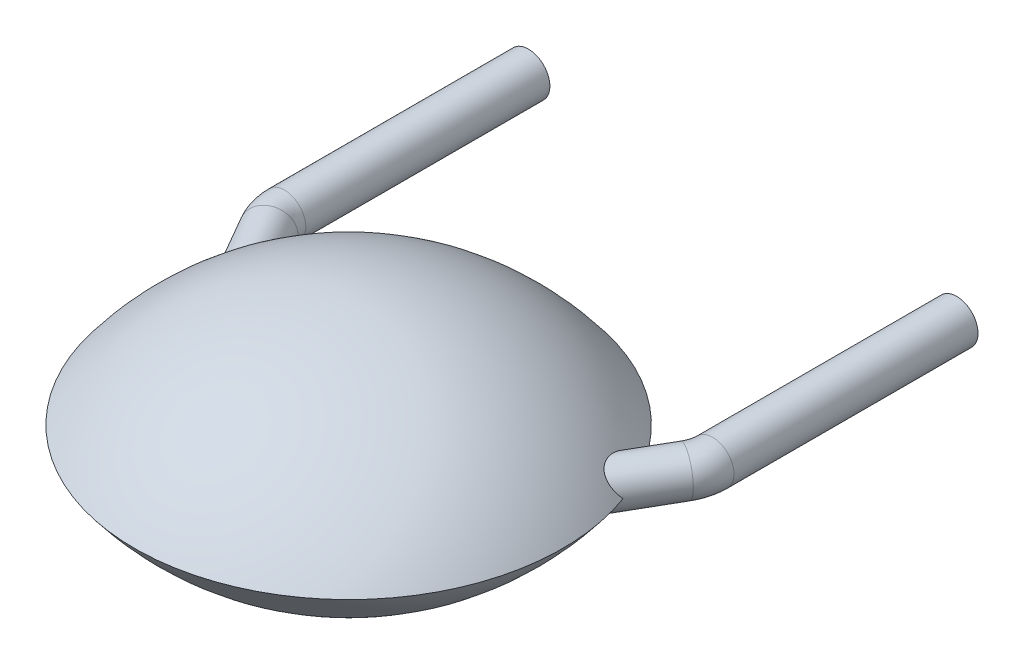
ISO-10303-21;
HEADER;
FILE_DESCRIPTION(('STEP AP214'),'2;1');
FILE_NAME('part.step','',(''),(''),'','','');
FILE_SCHEMA(('AUTOMOTIVE_DESIGN { 1 0 10303 214 1 1 1 1 }'));
ENDSEC;
DATA;
#1=APPLICATION_CONTEXT('core data for automotive mechanical design processes');
#2=APPLICATION_PROTOCOL_DEFINITION('international standard','automotive_design',2000,#1);
#3=PRODUCT_CONTEXT('',#1,'mechanical');
#4=PRODUCT('Part','Part','',(#3));
#5=PRODUCT_RELATED_PRODUCT_CATEGORY('part','',(#4));
#6=PRODUCT_DEFINITION_FORMATION('','',#4);
#7=PRODUCT_DEFINITION_CONTEXT('part definition',#1,'design');
#8=PRODUCT_DEFINITION('design','',#6,#7);
#9=PRODUCT_DEFINITION_SHAPE('','',#8);
#10=(LENGTH_UNIT() NAMED_UNIT(*) SI_UNIT(.MILLI.,.METRE.));
#11=(NAMED_UNIT(*) PLANE_ANGLE_UNIT() SI_UNIT($,.RADIAN.));
#12=(NAMED_UNIT(*) SI_UNIT($,.STERADIAN.) SOLID_ANGLE_UNIT());
#13=UNCERTAINTY_MEASURE_WITH_UNIT(LENGTH_MEASURE(1.E-05),#10,'distance_accuracy_value','');
#14=(GEOMETRIC_REPRESENTATION_CONTEXT(3) GLOBAL_UNCERTAINTY_ASSIGNED_CONTEXT((#13)) GLOBAL_UNIT_ASSIGNED_CONTEXT((#10,
#11,#12)) REPRESENTATION_CONTEXT('',''));
#15=CARTESIAN_POINT('',(0.,0.,0.));
#16=DIRECTION('',(0.,0.,1.));
#17=DIRECTION('',(1.,0.,0.));
#18=AXIS2_PLACEMENT_3D('',#15,#16,#17);
#19=CARTESIAN_POINT('',(-0.255,-0.25,-2.));
#20=DIRECTION('',(0.,0.,-1.));
#21=DIRECTION('',(0.,1.,0.));
#22=AXIS2_PLACEMENT_3D('',#19,#20,#21);
#23=PLANE('',#22);
#24=CARTESIAN_POINT('',(0.,1.26553498583371E-13,-2.));
#25=DIRECTION('',(0.,0.,-1.));
#26=DIRECTION('',(-1.,0.,0.));
#27=AXIS2_PLACEMENT_3D('',#24,#25,#26);
#28=CIRCLE('',#27,0.249999999999979);
#29=CARTESIAN_POINT('',(-0.249999999999979,1.26553498583371E-13,-2.));
#30=VERTEX_POINT('',#29);
#31=EDGE_CURVE('E22',#30,#30,#28,.F.);
#32=ORIENTED_EDGE('',*,*,#31,.F.);
#33=EDGE_LOOP('',(#32));
#34=FACE_BOUND('',#33,.T.);
#35=ADVANCED_FACE('F17',(#34),#23,.T.);
#36=CARTESIAN_POINT('',(5.255,0.25,-2.));
#37=DIRECTION('',(0.,0.,-1.));
#38=DIRECTION('',(0.,-1.,0.));
#39=AXIS2_PLACEMENT_3D('',#36,#37,#38);
#40=PLANE('',#39);
#41=CARTESIAN_POINT('',(5.,-1.2693296934374E-13,-2.));
#42=DIRECTION('',(0.,0.,-1.));
#43=DIRECTION('',(-1.,0.,0.));
#44=AXIS2_PLACEMENT_3D('',#41,#42,#43);
#45=CIRCLE('',#44,0.24999999999998);
#46=CARTESIAN_POINT('',(4.75000000000002,-1.2693296934374E-13,-2.));
#47=VERTEX_POINT('',#46);
#48=EDGE_CURVE('E87',#47,#47,#45,.F.);
#49=ORIENTED_EDGE('',*,*,#48,.F.);
#50=EDGE_LOOP('',(#49));
#51=FACE_BOUND('',#50,.T.);
#52=ADVANCED_FACE('F105',(#51),#40,.T.);
#53=CARTESIAN_POINT('',(0.,1.26553498583371E-13,0.85));
#54=DIRECTION('',(0.,0.,-1.));
#55=DIRECTION('',(-1.,0.,0.));
#56=AXIS2_PLACEMENT_3D('',#53,#54,#55);
#57=CYLINDRICAL_SURFACE('',#56,0.249999999999979);
#58=CARTESIAN_POINT('',(0.,1.26770339017868E-13,0.85));
#59=DIRECTION('',(0.,0.,-1.));
#60=DIRECTION('',(-1.,0.,0.));
#61=AXIS2_PLACEMENT_3D('',#58,#59,#60);
#62=CIRCLE('',#61,0.249999999999979);
#63=CARTESIAN_POINT('',(-0.249999999999979,1.26770339017868E-13,0.85));
#64=VERTEX_POINT('',#63);
#65=EDGE_CURVE('E65',#64,#64,#62,.T.);
#66=ORIENTED_EDGE('',*,*,#65,.T.);
#67=EDGE_LOOP('',(#66));
#68=FACE_BOUND('',#67,.T.);
#69=ORIENTED_EDGE('',*,*,#31,.T.);
#70=EDGE_LOOP('',(#69));
#71=FACE_BOUND('',#70,.T.);
#72=ADVANCED_FACE('F101',(#68,#71),#57,.T.);
#73=CARTESIAN_POINT('',(5.,-1.2693296934374E-13,0.85));
#74=DIRECTION('',(0.,0.,-1.));
#75=DIRECTION('',(-1.,0.,0.));
#76=AXIS2_PLACEMENT_3D('',#73,#74,#75);
#77=CYLINDRICAL_SURFACE('',#76,0.24999999999998);
#78=ORIENTED_EDGE('',*,*,#48,.T.);
#79=EDGE_LOOP('',(#78));
#80=FACE_BOUND('',#79,.T.);
#81=CARTESIAN_POINT('',(5.,-1.27082047142457E-13,0.85));
#82=DIRECTION('',(0.,0.,-1.));
#83=DIRECTION('',(-1.,0.,0.));
#84=AXIS2_PLACEMENT_3D('',#81,#82,#83);
#85=CIRCLE('',#84,0.249999999999979);
#86=CARTESIAN_POINT('',(5.24999999999998,-1.27082047142457E-13,0.85));
#87=VERTEX_POINT('',#86);
#88=EDGE_CURVE('E316',#87,#87,#85,.T.);
#89=ORIENTED_EDGE('',*,*,#88,.T.);
#90=EDGE_LOOP('',(#89));
#91=FACE_BOUND('',#90,.T.);
#92=ADVANCED_FACE('F97',(#80,#91),#77,.T.);
#93=CARTESIAN_POINT('',(0.499999999998368,1.26770339017868E-13,0.85));
#94=DIRECTION('',(0.,1.,0.));
#95=DIRECTION('',(0.,0.,1.));
#96=AXIS2_PLACEMENT_3D('',#93,#94,#95);
#97=TOROIDAL_SURFACE('',#96,0.499999999998368,0.249999999999979);
#98=CARTESIAN_POINT('',(0.0669872981077983,1.41637461308075E-13,1.10000000000003));
#99=DIRECTION('',(0.50000000000003,-1.46384386899602E-13,0.866025403784421));
#100=DIRECTION('',(0.866025403784421,0.,-0.50000000000003));
#101=AXIS2_PLACEMENT_3D('',#98,#99,#100);
#102=CIRCLE('',#101,0.24999999999994);
#103=CARTESIAN_POINT('',(-0.14951905283789,1.49071022453193E-13,1.22500000000028));
#104=VERTEX_POINT('',#103);
#105=EDGE_CURVE('E86',#104,#104,#102,.T.);
#106=CARTESIAN_POINT('',(0.499999999998368,1.26770339017868E-13,0.85));
#107=DIRECTION('',(0.,1.,0.));
#108=DIRECTION('',(0.,0.,1.));
#109=AXIS2_PLACEMENT_3D('',#106,#107,#108);
#110=CIRCLE('',#109,0.749999999998347);
#111=EDGE_CURVE('',#64,#104,#110,.T.);
#112=ORIENTED_EDGE('',*,*,#65,.F.);
#113=ORIENTED_EDGE('',*,*,#105,.F.);
#114=ORIENTED_EDGE('',*,*,#111,.T.);
#115=ORIENTED_EDGE('',*,*,#111,.F.);
#116=EDGE_LOOP('',(#112,#114,#113,#115));
#117=FACE_BOUND('',#116,.T.);
#118=ADVANCED_FACE('F93',(#117),#97,.T.);
#119=CARTESIAN_POINT('',(4.50000000000283,-1.27082047142457E-13,0.85));
#120=DIRECTION('',(0.,-1.,0.));
#121=DIRECTION('',(0.,0.,-1.));
#122=AXIS2_PLACEMENT_3D('',#119,#120,#121);
#123=TOROIDAL_SURFACE('',#122,0.499999999997168,0.249999999999979);
#124=CARTESIAN_POINT('',(4.933012701892,0.,1.1));
#125=DIRECTION('',(-0.499999999999811,0.,0.866025403784548));
#126=DIRECTION('',(0.866025403784548,0.,0.499999999999811));
#127=AXIS2_PLACEMENT_3D('',#124,#125,#126);
#128=CIRCLE('',#127,0.249999999999994);
#129=CARTESIAN_POINT('',(5.14951905283755,0.,1.22500000000056));
#130=VERTEX_POINT('',#129);
#131=EDGE_CURVE('E54',#130,#130,#128,.T.);
#132=CARTESIAN_POINT('',(4.50000000000283,-1.27082047142457E-13,0.85));
#133=DIRECTION('',(0.,-1.,0.));
#134=DIRECTION('',(0.,0.,-1.));
#135=AXIS2_PLACEMENT_3D('',#132,#133,#134);
#136=CIRCLE('',#135,0.749999999997148);
#137=EDGE_CURVE('',#87,#130,#136,.T.);
#138=ORIENTED_EDGE('',*,*,#88,.F.);
#139=ORIENTED_EDGE('',*,*,#131,.F.);
#140=ORIENTED_EDGE('',*,*,#137,.T.);
#141=ORIENTED_EDGE('',*,*,#137,.F.);
#142=EDGE_LOOP('',(#138,#140,#139,#141));
#143=FACE_BOUND('',#142,.T.);
#144=ADVANCED_FACE('F90',(#143),#123,.T.);
#145=CARTESIAN_POINT('',(0.432047896112033,-1.63335057284941E-13,1.73230350358406));
#146=DIRECTION('',(-0.49999999999942,2.59718178649785E-13,-0.866025403784774));
#147=DIRECTION('',(-0.866025403784774,0.,0.49999999999942));
#148=AXIS2_PLACEMENT_3D('',#145,#146,#147);
#149=CYLINDRICAL_SURFACE('',#148,0.249999999999962);
#150=CARTESIAN_POINT('',(0.420502910737567,2.39389986035229E-13,1.21230700234231));
#151=CARTESIAN_POINT('',(0.427297045209515,0.0162865407089759,1.22413023744057));
#152=CARTESIAN_POINT('',(0.433050977576928,0.0319920683808771,1.23721663849491));
#153=CARTESIAN_POINT('',(0.442659705904672,0.0620426895530233,1.26535228004791));
#154=CARTESIAN_POINT('',(0.446523503391992,0.076393963248698,1.28039177674211));
#155=CARTESIAN_POINT('',(0.45392733113162,0.10969010726406,1.31893045129104));
#156=CARTESIAN_POINT('',(0.456580477130958,0.127885525777837,1.34324485482007));
#157=CARTESIAN_POINT('',(0.45877685076235,0.161175058839322,1.39419877777848));
#158=CARTESIAN_POINT('',(0.458303644892437,0.176252355084398,1.42084985586591));
#159=CARTESIAN_POINT('',(0.454246934571025,0.202957953368596,1.47591772574734));
#160=CARTESIAN_POINT('',(0.450633941660921,0.214552149316315,1.50434887979139));
#161=CARTESIAN_POINT('',(0.439990762536356,0.233389052590254,1.56191626462155));
#162=CARTESIAN_POINT('',(0.432981670011264,0.240658011671839,1.59104710172731));
#163=CARTESIAN_POINT('',(0.420740846852407,0.2466815857034,1.6300060383598));
#164=CARTESIAN_POINT('',(0.417325503256664,0.247898059127778,1.64004696376177));
#165=CARTESIAN_POINT('',(0.40993164415724,0.249557409269351,1.65999537089405));
#166=CARTESIAN_POINT('',(0.405952879288816,0.249999942284038,1.66990279139855));
#167=CARTESIAN_POINT('',(0.396763605701014,0.250000065893,1.69085460050628));
#168=CARTESIAN_POINT('',(0.391458306012679,0.249421915418856,1.70185873540847));
#169=CARTESIAN_POINT('',(0.37995479011234,0.246902996902976,1.72323914433858));
#170=CARTESIAN_POINT('',(0.373757140969817,0.244963091216926,1.73361581120726));
#171=CARTESIAN_POINT('',(0.361649951424475,0.240003125401469,1.75150417677863));
#172=CARTESIAN_POINT('',(0.355896153185416,0.237246523618601,1.75919222876594));
#173=CARTESIAN_POINT('',(0.343800699800724,0.230588144916591,1.7735454784127));
#174=CARTESIAN_POINT('',(0.337459689341628,0.226687613926884,1.78021177696648));
#175=CARTESIAN_POINT('',(0.324251741098786,0.217691278489583,1.79223238657972));
#176=CARTESIAN_POINT('',(0.317380739512804,0.212585456621038,1.79757488792387));
#177=CARTESIAN_POINT('',(0.303396838953198,0.201328113425224,1.80657587835233));
#178=CARTESIAN_POINT('',(0.296284042692356,0.195177031784698,1.81023507312723));
#179=CARTESIAN_POINT('',(0.283045427623718,0.182962616763242,1.8153962090145));
#180=CARTESIAN_POINT('',(0.276914250807034,0.176996576244994,1.81712045724317));
#181=CARTESIAN_POINT('',(0.264836380457348,0.164664173727774,1.81928596597475));
#182=CARTESIAN_POINT('',(0.258889752272092,0.158297672289361,1.81972677703349));
#183=CARTESIAN_POINT('',(0.245009229256232,0.14278386371494,1.81939988632287));
#184=CARTESIAN_POINT('',(0.237212140194502,0.133526462590372,1.81808953209758));
#185=CARTESIAN_POINT('',(0.222320654489911,0.114877156640793,1.81365473015102));
#186=CARTESIAN_POINT('',(0.215228175495276,0.105484960304012,1.81052548244223));
#187=CARTESIAN_POINT('',(0.198436479373446,0.0820994414028457,1.80092379167508));
#188=CARTESIAN_POINT('',(0.189198153788796,0.0681441497888136,1.79356249901632));
#189=CARTESIAN_POINT('',(0.172324866275418,0.0406914782069809,1.77658508002494));
#190=CARTESIAN_POINT('',(0.164690448395588,0.0271942549143983,1.76696819092273));
#191=CARTESIAN_POINT('',(0.155352349120153,0.00928703044656987,1.75279466524938));
#192=CARTESIAN_POINT('',(0.152996105832129,0.00462384273548277,1.74896875579585));
#193=CARTESIAN_POINT('',(0.150731935252958,0.,1.74504996639581));
#194=B_SPLINE_CURVE_WITH_KNOTS('',3,(#150,#151,#152,#153,#154,#155,#156,#157,#158,#159,#160,
#161,#162,#163,#164,#165,#166,#167,#168,#169,#170,#171,#172,#173,#174,#175,#176,#177,#178,#179,
#180,#181,#182,#183,#184,#185,#186,#187,#188,#189,#190,#191,#192,#193),.UNSPECIFIED.,.F.,.F.,(4,
2,2,2,2,2,2,2,2,2,2,2,2,2,2,2,2,2,2,2,2,4),(0.,0.0635408324490006,0.126776040233785,
0.217773469902749,0.309249601881956,0.401594265385087,0.493372575202932,0.525365886287989,
0.557373401815039,0.593962578317446,0.630528604952221,0.660386214100727,0.690211423352895,
0.72029383141565,0.750363616547644,0.776431074614141,0.802507660092001,0.838826039319604,
0.875240699265292,0.929790545855562,0.984358866100693,1.00377729719556),.UNSPECIFIED.);
#195=CARTESIAN_POINT('',(0.42050291073755,4.10988589655373E-13,1.21230700234228));
#196=VERTEX_POINT('',#195);
#197=CARTESIAN_POINT('',(0.150731935253001,0.,1.74504996639589));
#198=VERTEX_POINT('',#197);
#199=EDGE_CURVE('E48',#196,#198,#194,.T.);
#200=ORIENTED_EDGE('',*,*,#199,.F.);
#201=CARTESIAN_POINT('',(0.150731935253043,-1.5147666491186E-13,1.74504996639596));
#202=CARTESIAN_POINT('',(0.158069546110411,-0.0149620895713352,1.7576803020235));
#203=CARTESIAN_POINT('',(0.166408260218829,-0.0304360475435922,1.76949406617795));
#204=CARTESIAN_POINT('',(0.185351820298398,-0.0622668893354946,1.79038408883657));
#205=CARTESIAN_POINT('',(0.195992273599596,-0.0786342187598399,1.79941119672931));
#206=CARTESIAN_POINT('',(0.213952224200793,-0.103737102356062,1.80985045374757));
#207=CARTESIAN_POINT('',(0.220440053552871,-0.112395102234936,1.81284177090283));
#208=CARTESIAN_POINT('',(0.23400497995342,-0.129596410206035,1.81730669948079));
#209=CARTESIAN_POINT('',(0.241079279843302,-0.138140059881649,1.81878711239551));
#210=CARTESIAN_POINT('',(0.254650670008347,-0.153661350784662,1.81983676220569));
#211=CARTESIAN_POINT('',(0.261076575072665,-0.160682564593136,1.81965802524135));
#212=CARTESIAN_POINT('',(0.274178822328835,-0.174289294516401,1.8177926009496));
#213=CARTESIAN_POINT('',(0.280855103200753,-0.180874916234801,1.81610628056584));
#214=CARTESIAN_POINT('',(0.294298915903356,-0.19339799565609,1.81112196349096));
#215=CARTESIAN_POINT('',(0.301066750337813,-0.199331573683687,1.80781489853012));
#216=CARTESIAN_POINT('',(0.314413111043318,-0.210277223890304,1.79965949351169));
#217=CARTESIAN_POINT('',(0.320991673498804,-0.215289473206863,1.79481145021763));
#218=CARTESIAN_POINT('',(0.333156360571336,-0.223846296378655,1.78432058478773));
#219=CARTESIAN_POINT('',(0.338777960506422,-0.227483833470902,1.77879304091473));
#220=CARTESIAN_POINT('',(0.3496002793179,-0.233886173997786,1.76688520756088));
#221=CARTESIAN_POINT('',(0.354800595967076,-0.236650150522158,1.7605041181977));
#222=CARTESIAN_POINT('',(0.367132935910447,-0.242479461710536,1.7438758251533));
#223=CARTESIAN_POINT('',(0.373986378414888,-0.24504675900636,1.73324875134983));
#224=CARTESIAN_POINT('',(0.386676583557055,-0.248594694405835,1.71118048875771));
#225=CARTESIAN_POINT('',(0.39251316766259,-0.249575054137185,1.69973915750366));
#226=CARTESIAN_POINT('',(0.399171405921399,-0.249963145158716,1.68529493164577));
#227=CARTESIAN_POINT('',(0.400430845280947,-0.249999868144702,1.68249279366295));
#228=CARTESIAN_POINT('',(0.410170171514729,-0.250000908576794,1.6602899628853));
#229=CARTESIAN_POINT('',(0.417480530078352,-0.24826440396279,1.64034740045281));
#230=CARTESIAN_POINT('',(0.4301127987804,-0.242091077068239,1.6002128133639));
#231=CARTESIAN_POINT('',(0.435423619948597,-0.237639544531413,1.58002002094819));
#232=CARTESIAN_POINT('',(0.446059898883694,-0.224332103335331,1.53199406797523));
#233=CARTESIAN_POINT('',(0.45057550494833,-0.214433828209814,1.50426781569258));
#234=CARTESIAN_POINT('',(0.456633031279002,-0.191086861637692,1.45002386973834));
#235=CARTESIAN_POINT('',(0.458172319458583,-0.17763503957204,1.42350726602326));
#236=CARTESIAN_POINT('',(0.458328544441139,-0.147304628145939,1.37183021729297));
#237=CARTESIAN_POINT('',(0.456890532089952,-0.130366894914194,1.34670421839335));
#238=CARTESIAN_POINT('',(0.450766785400385,-0.093549367623661,1.2992360799175));
#239=CARTESIAN_POINT('',(0.446094848658999,-0.0736823537313086,1.27688258737588));
#240=CARTESIAN_POINT('',(0.437006749266394,-0.0441553948540746,1.24845703285721));
#241=CARTESIAN_POINT('',(0.43414645606246,-0.0355934504470224,1.24071777392446));
#242=CARTESIAN_POINT('',(0.427803087889086,-0.0180804244863632,1.22595028774229));
#243=CARTESIAN_POINT('',(0.424319363396364,-0.0091289445269859,1.2189228141417));
#244=CARTESIAN_POINT('',(0.420502910737568,-2.40632941098382E-13,1.21230700234231));
#245=B_SPLINE_CURVE_WITH_KNOTS('',3,(#201,#202,#203,#204,#205,#206,#207,#208,#209,#210,#211,
#212,#213,#214,#215,#216,#217,#218,#219,#220,#221,#222,#223,#224,#225,#226,#227,#228,#229,#230,
#231,#232,#233,#234,#235,#236,#237,#238,#239,#240,#241,#242,#243,#244),.UNSPECIFIED.,.F.,.F.,(4,
2,2,2,2,2,2,2,2,2,2,2,2,2,2,2,2,2,2,2,2,4),(0.,0.0630548205121403,0.127165464985865,
0.160744649437198,0.194171997948385,0.222615770617751,0.25105262199751,0.279650429600491,
0.308242733135362,0.334185515792382,0.360152782777888,0.398648945036248,0.43715185935889,
0.446369113545147,0.509882490921038,0.573743084570674,0.662629445167236,0.751594375924578,
0.842215872314368,0.932453094536842,0.968087316367258,1.00375888225338),.UNSPECIFIED.);
#246=EDGE_CURVE('E45',#198,#196,#245,.T.);
#247=ORIENTED_EDGE('',*,*,#246,.F.);
#248=EDGE_LOOP('',(#200,#247));
#249=FACE_BOUND('',#248,.T.);
#250=ORIENTED_EDGE('',*,*,#105,.T.);
#251=EDGE_LOOP('',(#250));
#252=FACE_BOUND('',#251,.T.);
#253=ADVANCED_FACE('F73',(#249,#252),#149,.T.);
#254=CARTESIAN_POINT('',(4.56430149790796,0.,1.73862653861883));
#255=DIRECTION('',(0.499999999999809,0.,-0.866025403784549));
#256=DIRECTION('',(-0.866025403784549,0.,-0.499999999999809));
#257=AXIS2_PLACEMENT_3D('',#254,#255,#256);
#258=CYLINDRICAL_SURFACE('',#257,0.249999999999995);
#259=ORIENTED_EDGE('',*,*,#131,.T.);
#260=EDGE_LOOP('',(#259));
#261=FACE_BOUND('',#260,.T.);
#262=CARTESIAN_POINT('',(4.5794970892622,-3.19478933308572E-13,1.21230700234206));
#263=CARTESIAN_POINT('',(4.57270295479025,-0.0162865407090583,1.22413023744032));
#264=CARTESIAN_POINT('',(4.56694902242283,-0.0319920683809638,1.23721663849466));
#265=CARTESIAN_POINT('',(4.55734029409507,-0.0620426895531195,1.26535228004765));
#266=CARTESIAN_POINT('',(4.55347649660774,-0.0763939632487996,1.28039177674185));
#267=CARTESIAN_POINT('',(4.5460726688681,-0.109690107264174,1.31893045129077));
#268=CARTESIAN_POINT('',(4.54341952286876,-0.127885525777958,1.3432448548198));
#269=CARTESIAN_POINT('',(4.54122314923735,-0.16117505883946,1.3941987777782));
#270=CARTESIAN_POINT('',(4.54169635510725,-0.176252355084546,1.42084985586563));
#271=CARTESIAN_POINT('',(4.54575306542865,-0.202957953368766,1.47591772574706));
#272=CARTESIAN_POINT('',(4.54936605833875,-0.214552149316498,1.50434887979111));
#273=CARTESIAN_POINT('',(4.5600092374633,-0.233389052590444,1.56191626462127));
#274=CARTESIAN_POINT('',(4.56701832998839,-0.240658011672024,1.59104710172704));
#275=CARTESIAN_POINT('',(4.57925915314725,-0.24668158570361,1.63000603835951));
#276=CARTESIAN_POINT('',(4.58267449674299,-0.247898059127998,1.64004696376147));
#277=CARTESIAN_POINT('',(4.5900683558424,-0.249557409269547,1.65999537089373));
#278=CARTESIAN_POINT('',(4.59404712071081,-0.249999942284201,1.66990279139823));
#279=CARTESIAN_POINT('',(4.6032363942986,-0.250000065893162,1.69085460050595));
#280=CARTESIAN_POINT('',(4.60854169398695,-0.24942191541906,1.70185873540812));
#281=CARTESIAN_POINT('',(4.62004520988729,-0.246902996903214,1.72323914433821));
#282=CARTESIAN_POINT('',(4.6262428590298,-0.244963091217158,1.73361581120688));
#283=CARTESIAN_POINT('',(4.63835004857514,-0.240003125401703,1.75150417677824));
#284=CARTESIAN_POINT('',(4.6441038468142,-0.237246523618839,1.75919222876555));
#285=CARTESIAN_POINT('',(4.65619930019889,-0.230588144916836,1.77354547841231));
#286=CARTESIAN_POINT('',(4.66254031065798,-0.226687613927131,1.78021177696609));
#287=CARTESIAN_POINT('',(4.67574825890083,-0.217691278489834,1.79223238657933));
#288=CARTESIAN_POINT('',(4.68261926048681,-0.212585456621292,1.79757488792348));
#289=CARTESIAN_POINT('',(4.69660316104641,-0.201328113425484,1.80657587835193));
#290=CARTESIAN_POINT('',(4.70371595730726,-0.195177031784961,1.81023507312684));
#291=CARTESIAN_POINT('',(4.7169545723759,-0.182962616763509,1.81539620901412));
#292=CARTESIAN_POINT('',(4.72308574919258,-0.17699657624526,1.81712045724278));
#293=CARTESIAN_POINT('',(4.73516361954227,-0.164664173728041,1.81928596597437));
#294=CARTESIAN_POINT('',(4.74111024772753,-0.158297672289628,1.81972677703312));
#295=CARTESIAN_POINT('',(4.7549907707434,-0.142783863715204,1.8193998863225));
#296=CARTESIAN_POINT('',(4.76278785980514,-0.13352646259063,1.81808953209721));
#297=CARTESIAN_POINT('',(4.77767934550975,-0.114877156641041,1.81365473015066));
#298=CARTESIAN_POINT('',(4.78477182450439,-0.105484960304254,1.81052548244186));
#299=CARTESIAN_POINT('',(4.80156352062624,-0.0820994414030722,1.80092379167472));
#300=CARTESIAN_POINT('',(4.8108018462109,-0.0681441497890298,1.79356249901596));
#301=CARTESIAN_POINT('',(4.82767513372429,-0.0406914782071761,1.77658508002459));
#302=CARTESIAN_POINT('',(4.83530955160413,-0.0271942549145827,1.76696819092237));
#303=CARTESIAN_POINT('',(4.84464765087958,-0.00928703044674211,1.75279466524903));
#304=CARTESIAN_POINT('',(4.8470038941676,-0.00462384273565419,1.74896875579549));
#305=CARTESIAN_POINT('',(4.84926806474678,-1.48016485413765E-13,1.74504996639546));
#306=B_SPLINE_CURVE_WITH_KNOTS('',3,(#262,#263,#264,#265,#266,#267,#268,#269,#270,#271,#272,
#273,#274,#275,#276,#277,#278,#279,#280,#281,#282,#283,#284,#285,#286,#287,#288,#289,#290,#291,
#292,#293,#294,#295,#296,#297,#298,#299,#300,#301,#302,#303,#304,#305),.UNSPECIFIED.,.F.,.F.,(4,
2,2,2,2,2,2,2,2,2,2,2,2,2,2,2,2,2,2,2,2,4),(0.,0.0635408324490097,0.126776040233799,
0.217773469902769,0.309249601881987,0.401594265385129,0.493372575202974,0.525365886288001,
0.557373401815024,0.593962578317401,0.630528604952141,0.660386214100642,0.690211423352808,
0.720293831415559,0.75036361654755,0.776431074614052,0.802507660091917,0.838826039319544,
0.875240699265257,0.929790545855565,0.984358866100733,1.0037772971956),.UNSPECIFIED.);
#307=CARTESIAN_POINT('',(4.5794970892622,0.,1.21230700234206));
#308=VERTEX_POINT('',#307);
#309=CARTESIAN_POINT('',(4.8492680647468,1.6237201702297E-13,1.74504996639542));
#310=VERTEX_POINT('',#309);
#311=EDGE_CURVE('E28',#308,#310,#306,.T.);
#312=ORIENTED_EDGE('',*,*,#311,.F.);
#313=CARTESIAN_POINT('',(4.5794970892622,3.20395187520837E-13,1.21230700234206));
#314=CARTESIAN_POINT('',(4.57270295479044,0.0162865407085237,1.22413023743997));
#315=CARTESIAN_POINT('',(4.56694902242318,0.031992068379985,1.23721663849387));
#316=CARTESIAN_POINT('',(4.55734029409533,0.0620426895522529,1.26535228004674));
#317=CARTESIAN_POINT('',(4.55347649660786,0.0763939632484109,1.28039177674137));
#318=CARTESIAN_POINT('',(4.54607266886796,0.109690107264747,1.31893045129153));
#319=CARTESIAN_POINT('',(4.54341952286853,0.127885525778906,1.34324485482143));
#320=CARTESIAN_POINT('',(4.54122314923749,0.161175058840627,1.39419877777989));
#321=CARTESIAN_POINT('',(4.54169635510766,0.176252355085766,1.42084985586636));
#322=CARTESIAN_POINT('',(4.54575306542824,0.202957953367003,1.47591772574537));
#323=CARTESIAN_POINT('',(4.54936605833713,0.214552149311809,1.50434887978792));
#324=CARTESIAN_POINT('',(4.56000923746356,0.233389052592458,1.56191626461663));
#325=CARTESIAN_POINT('',(4.56701832999217,0.240658011683019,1.59104710172258));
#326=CARTESIAN_POINT('',(4.57925915320836,0.24668158573039,1.63000603855952));
#327=CARTESIAN_POINT('',(4.58267449687416,0.247898059165752,1.64004696416082));
#328=CARTESIAN_POINT('',(4.59006835614976,0.249557409330021,1.65999537167709));
#329=CARTESIAN_POINT('',(4.59404712112424,0.249999942356513,1.66990279236627));
#330=CARTESIAN_POINT('',(4.60323639482002,0.250000065894686,1.69085460157381));
#331=CARTESIAN_POINT('',(4.60854169449048,0.249421915353955,1.70185873639877));
#332=CARTESIAN_POINT('',(4.6200452103625,0.246902996753977,1.72323914516653));
#333=CARTESIAN_POINT('',(4.62624285949462,0.244963091050312,1.73361581195007));
#334=CARTESIAN_POINT('',(4.63835004902656,0.240003125197447,1.75150417739899));
#335=CARTESIAN_POINT('',(4.64410384726754,0.237246523390431,1.7591922293459));
#336=CARTESIAN_POINT('',(4.65619930065198,0.230588144646245,1.77354547890753));
#337=CARTESIAN_POINT('',(4.6625403111089,0.22668761363855,1.78021177741662));
#338=CARTESIAN_POINT('',(4.67574825933995,0.217691278171988,1.79223238693837));
#339=CARTESIAN_POINT('',(4.6826192609162,0.212585456292371,1.79757488823588));
#340=CARTESIAN_POINT('',(4.69660316145004,0.201328113083766,1.80657587857561));
#341=CARTESIAN_POINT('',(4.70371595769485,0.195177031441466,1.81023507330833));
#342=CARTESIAN_POINT('',(4.71695457274155,0.182962616413807,1.81539620913008));
#343=CARTESIAN_POINT('',(4.72308574955282,0.176996575888859,1.8171204573316));
#344=CARTESIAN_POINT('',(4.73516361988915,0.164664173362365,1.81928596601217));
#345=CARTESIAN_POINT('',(4.74111024806647,0.158297671921381,1.81972677704706));
#346=CARTESIAN_POINT('',(4.75499077108864,0.142783863314566,1.81939988628368));
#347=CARTESIAN_POINT('',(4.76278786016217,0.133526462160104,1.818089532024));
#348=CARTESIAN_POINT('',(4.77767934588536,0.114877156153896,1.81365473000538));
#349=CARTESIAN_POINT('',(4.78477182488677,0.105484959790386,1.81052548225887));
#350=CARTESIAN_POINT('',(4.80156352102834,0.0820994408150475,1.80092379139121));
#351=CARTESIAN_POINT('',(4.81080184662208,0.0681441491555374,1.79356249866626));
#352=CARTESIAN_POINT('',(4.82767513414342,0.0406914774896854,1.7765850795387));
#353=CARTESIAN_POINT('',(4.83530955202224,0.0271942541585315,1.76696819036664));
#354=CARTESIAN_POINT('',(4.8446476511441,0.00928702992336227,1.75279466481982));
#355=CARTESIAN_POINT('',(4.84700389429467,0.00462384247626404,1.74896875557582));
#356=CARTESIAN_POINT('',(4.84926806474669,3.22022890493245E-13,1.74504996639561));
#357=B_SPLINE_CURVE_WITH_KNOTS('',3,(#313,#314,#315,#316,#317,#318,#319,#320,#321,#322,#323,
#324,#325,#326,#327,#328,#329,#330,#331,#332,#333,#334,#335,#336,#337,#338,#339,#340,#341,#342,
#343,#344,#345,#346,#347,#348,#349,#350,#351,#352,#353,#354,#355,#356),.UNSPECIFIED.,.F.,.F.,(4,
2,2,2,2,2,2,2,2,2,2,2,2,2,2,2,2,2,2,2,2,4),(0.,0.0635408324470756,0.1267760402338,
0.217773469905696,0.30924960188199,0.401594265378826,0.493372575202973,0.52536588692054,
0.557373403076579,0.593962579356405,0.630528605770735,0.660386214848361,0.690211424028537,
0.720293832015011,0.750363617072242,0.776431075125438,0.802507660589683,0.838826039918585,
0.875240699966871,0.929790546754131,0.984358867192559,1.00377729719721),.UNSPECIFIED.);
#358=EDGE_CURVE('E36',#308,#310,#357,.T.);
#359=ORIENTED_EDGE('',*,*,#358,.T.);
#360=EDGE_LOOP('',(#312,#359));
#361=FACE_BOUND('',#360,.T.);
#362=ADVANCED_FACE('F52',(#261,#361),#258,.T.);
#363=CARTESIAN_POINT('',(2.5,-1.875,2.6));
#364=DIRECTION('',(0.,-1.,0.));
#365=DIRECTION('',(-1.,0.,0.));
#366=AXIS2_PLACEMENT_3D('',#363,#364,#365);
#367=SPHERICAL_SURFACE('',#366,3.12500000000001);
#368=CARTESIAN_POINT('',(2.50000000000011,0.,2.6));
#369=DIRECTION('',(0.,-1.,0.));
#370=DIRECTION('',(0.,0.,-1.));
#371=AXIS2_PLACEMENT_3D('',#368,#369,#370);
#372=CIRCLE('',#371,2.49999999999998);
#373=EDGE_CURVE('E11',#310,#198,#372,.T.);
#374=ORIENTED_EDGE('',*,*,#373,.F.);
#375=ORIENTED_EDGE('',*,*,#358,.F.);
#376=CARTESIAN_POINT('',(2.50000000000011,0.,2.6));
#377=DIRECTION('',(0.,-1.,0.));
#378=DIRECTION('',(0.,0.,-1.));
#379=AXIS2_PLACEMENT_3D('',#376,#377,#378);
#380=CIRCLE('',#379,2.49999999999998);
#381=EDGE_CURVE('E56',#196,#308,#380,.T.);
#382=ORIENTED_EDGE('',*,*,#381,.F.);
#383=ORIENTED_EDGE('',*,*,#199,.T.);
#384=EDGE_LOOP('',(#374,#375,#382,#383));
#385=FACE_BOUND('',#384,.T.);
#386=ADVANCED_FACE('F47',(#385),#367,.T.);
#387=CARTESIAN_POINT('',(2.5,1.875,2.6));
#388=DIRECTION('',(0.,-1.,0.));
#389=DIRECTION('',(-1.,0.,0.));
#390=AXIS2_PLACEMENT_3D('',#387,#388,#389);
#391=SPHERICAL_SURFACE('',#390,3.125);
#392=ORIENTED_EDGE('',*,*,#311,.T.);
#393=ORIENTED_EDGE('',*,*,#373,.T.);
#394=ORIENTED_EDGE('',*,*,#246,.T.);
#395=ORIENTED_EDGE('',*,*,#381,.T.);
#396=EDGE_LOOP('',(#392,#393,#394,#395));
#397=FACE_BOUND('',#396,.T.);
#398=ADVANCED_FACE('F19',(#397),#391,.T.);
#399=CLOSED_SHELL('',(#35,#52,#72,#92,#118,#144,#253,#362,#386,#398));
#400=MANIFOLD_SOLID_BREP('B1',#399);
#401=ADVANCED_BREP_SHAPE_REPRESENTATION('',(#18,#400),#14);
#402=SHAPE_DEFINITION_REPRESENTATION(#9,#401);
ENDSEC;
END-ISO-10303-21;
